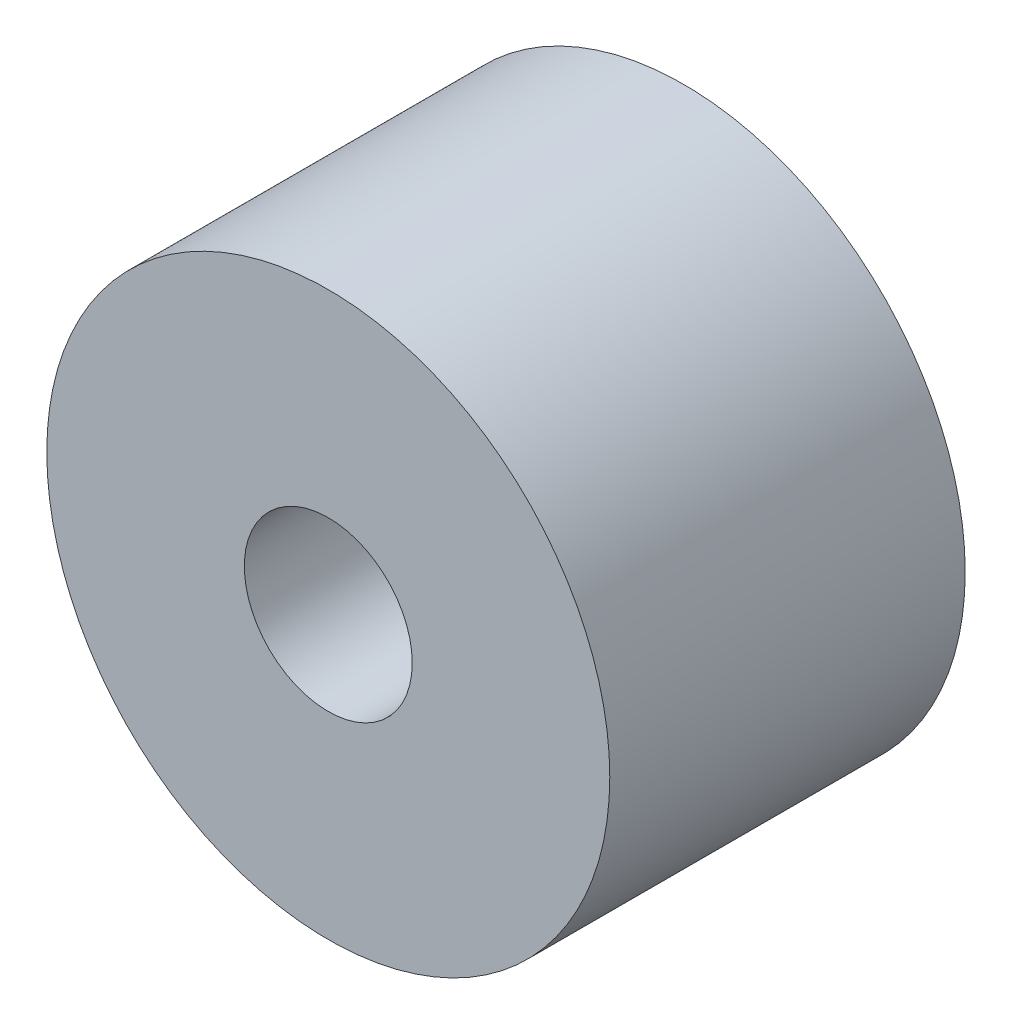
ISO-10303-21;
HEADER;
FILE_DESCRIPTION(('STEP AP214'),'2;1');
FILE_NAME('part.step','',(''),(''),'','','');
FILE_SCHEMA(('AUTOMOTIVE_DESIGN { 1 0 10303 214 1 1 1 1 }'));
ENDSEC;
DATA;
#1=APPLICATION_CONTEXT('core data for automotive mechanical design processes');
#2=APPLICATION_PROTOCOL_DEFINITION('international standard','automotive_design',2000,#1);
#3=PRODUCT_CONTEXT('',#1,'mechanical');
#4=PRODUCT('Part','Part','',(#3));
#5=PRODUCT_RELATED_PRODUCT_CATEGORY('part','',(#4));
#6=PRODUCT_DEFINITION_FORMATION('','',#4);
#7=PRODUCT_DEFINITION_CONTEXT('part definition',#1,'design');
#8=PRODUCT_DEFINITION('design','',#6,#7);
#9=PRODUCT_DEFINITION_SHAPE('','',#8);
#10=(LENGTH_UNIT() NAMED_UNIT(*) SI_UNIT(.MILLI.,.METRE.));
#11=(NAMED_UNIT(*) PLANE_ANGLE_UNIT() SI_UNIT($,.RADIAN.));
#12=(NAMED_UNIT(*) SI_UNIT($,.STERADIAN.) SOLID_ANGLE_UNIT());
#13=UNCERTAINTY_MEASURE_WITH_UNIT(LENGTH_MEASURE(1.E-05),#10,'distance_accuracy_value','');
#14=(GEOMETRIC_REPRESENTATION_CONTEXT(3) GLOBAL_UNCERTAINTY_ASSIGNED_CONTEXT((#13)) GLOBAL_UNIT_ASSIGNED_CONTEXT((#10,
#11,#12)) REPRESENTATION_CONTEXT('',''));
#15=CARTESIAN_POINT('',(0.,0.,0.));
#16=DIRECTION('',(0.,0.,1.));
#17=DIRECTION('',(1.,0.,0.));
#18=AXIS2_PLACEMENT_3D('',#15,#16,#17);
#19=CARTESIAN_POINT('',(0.,0.,12.7));
#20=DIRECTION('',(0.,0.,1.));
#21=DIRECTION('',(1.,0.,0.));
#22=AXIS2_PLACEMENT_3D('',#19,#20,#21);
#23=PLANE('',#22);
#24=CARTESIAN_POINT('',(0.,0.,12.7));
#25=DIRECTION('',(0.,0.,1.));
#26=DIRECTION('',(1.,0.,0.));
#27=AXIS2_PLACEMENT_3D('',#24,#25,#26);
#28=CIRCLE('',#27,10.0584);
#29=CARTESIAN_POINT('',(10.0584,0.,12.7));
#30=VERTEX_POINT('',#29);
#31=EDGE_CURVE('E12',#30,#30,#28,.T.);
#32=ORIENTED_EDGE('',*,*,#31,.T.);
#33=EDGE_LOOP('',(#32));
#34=FACE_BOUND('',#33,.T.);
#35=CARTESIAN_POINT('',(0.,0.,12.7));
#36=DIRECTION('',(0.,0.,1.));
#37=DIRECTION('',(1.,0.,0.));
#38=AXIS2_PLACEMENT_3D('',#35,#36,#37);
#39=CIRCLE('',#38,3.);
#40=CARTESIAN_POINT('',(3.,0.,12.7));
#41=VERTEX_POINT('',#40);
#42=EDGE_CURVE('E53',#41,#41,#39,.T.);
#43=ORIENTED_EDGE('',*,*,#42,.F.);
#44=EDGE_LOOP('',(#43));
#45=FACE_BOUND('',#44,.T.);
#46=ADVANCED_FACE('F42',(#34,#45),#23,.T.);
#47=CARTESIAN_POINT('',(0.,0.,0.));
#48=DIRECTION('',(0.,0.,1.));
#49=DIRECTION('',(1.,0.,0.));
#50=AXIS2_PLACEMENT_3D('',#47,#48,#49);
#51=PLANE('',#50);
#52=CARTESIAN_POINT('',(0.,0.,0.));
#53=DIRECTION('',(0.,0.,1.));
#54=DIRECTION('',(1.,0.,0.));
#55=AXIS2_PLACEMENT_3D('',#52,#53,#54);
#56=CIRCLE('',#55,10.0584);
#57=CARTESIAN_POINT('',(10.0584,0.,0.));
#58=VERTEX_POINT('',#57);
#59=EDGE_CURVE('E46',#58,#58,#56,.T.);
#60=ORIENTED_EDGE('',*,*,#59,.F.);
#61=EDGE_LOOP('',(#60));
#62=FACE_BOUND('',#61,.T.);
#63=CARTESIAN_POINT('',(0.,0.,0.));
#64=DIRECTION('',(0.,0.,1.));
#65=DIRECTION('',(1.,0.,0.));
#66=AXIS2_PLACEMENT_3D('',#63,#64,#65);
#67=CIRCLE('',#66,3.);
#68=CARTESIAN_POINT('',(3.,0.,0.));
#69=VERTEX_POINT('',#68);
#70=EDGE_CURVE('E55',#69,#69,#67,.T.);
#71=ORIENTED_EDGE('',*,*,#70,.T.);
#72=EDGE_LOOP('',(#71));
#73=FACE_BOUND('',#72,.T.);
#74=ADVANCED_FACE('F65',(#62,#73),#51,.F.);
#75=CARTESIAN_POINT('',(0.,0.,12.7));
#76=DIRECTION('',(0.,0.,-1.));
#77=DIRECTION('',(-1.,0.,0.));
#78=AXIS2_PLACEMENT_3D('',#75,#76,#77);
#79=CYLINDRICAL_SURFACE('',#78,10.0584);
#80=ORIENTED_EDGE('',*,*,#31,.F.);
#81=EDGE_LOOP('',(#80));
#82=FACE_BOUND('',#81,.T.);
#83=ORIENTED_EDGE('',*,*,#59,.T.);
#84=EDGE_LOOP('',(#83));
#85=FACE_BOUND('',#84,.T.);
#86=ADVANCED_FACE('F44',(#82,#85),#79,.T.);
#87=CARTESIAN_POINT('',(0.,0.,12.7));
#88=DIRECTION('',(0.,0.,-1.));
#89=DIRECTION('',(-1.,0.,0.));
#90=AXIS2_PLACEMENT_3D('',#87,#88,#89);
#91=CYLINDRICAL_SURFACE('',#90,3.);
#92=ORIENTED_EDGE('',*,*,#42,.T.);
#93=EDGE_LOOP('',(#92));
#94=FACE_BOUND('',#93,.T.);
#95=ORIENTED_EDGE('',*,*,#70,.F.);
#96=EDGE_LOOP('',(#95));
#97=FACE_BOUND('',#96,.T.);
#98=ADVANCED_FACE('F61',(#94,#97),#91,.F.);
#99=CLOSED_SHELL('',(#46,#74,#86,#98));
#100=MANIFOLD_SOLID_BREP('B2',#99);
#101=ADVANCED_BREP_SHAPE_REPRESENTATION('',(#18,#100),#14);
#102=SHAPE_DEFINITION_REPRESENTATION(#9,#101);
ENDSEC;
END-ISO-10303-21;
